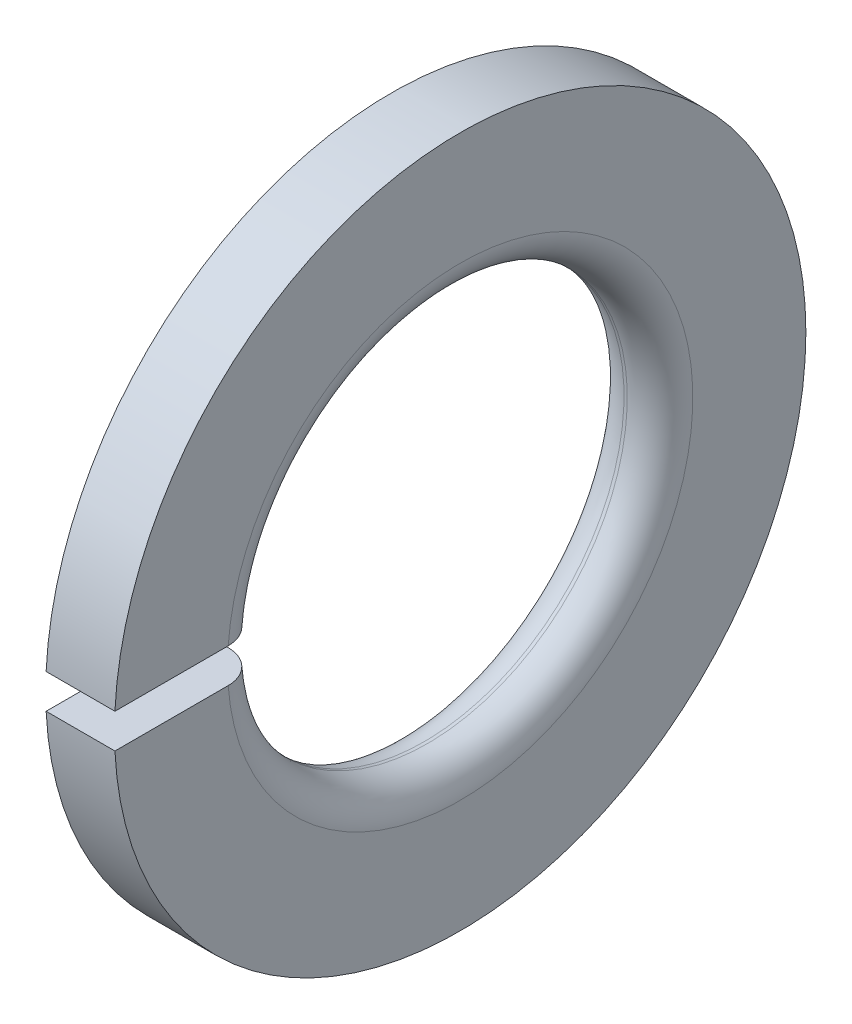
ISO-10303-21;
HEADER;
FILE_DESCRIPTION(('STEP AP214'),'2;1');
FILE_NAME('part.step','',(''),(''),'','','');
FILE_SCHEMA(('AUTOMOTIVE_DESIGN { 1 0 10303 214 1 1 1 1 }'));
ENDSEC;
DATA;
#1=APPLICATION_CONTEXT('core data for automotive mechanical design processes');
#2=APPLICATION_PROTOCOL_DEFINITION('international standard','automotive_design',2000,#1);
#3=PRODUCT_CONTEXT('',#1,'mechanical');
#4=PRODUCT('Part','Part','',(#3));
#5=PRODUCT_RELATED_PRODUCT_CATEGORY('part','',(#4));
#6=PRODUCT_DEFINITION_FORMATION('','',#4);
#7=PRODUCT_DEFINITION_CONTEXT('part definition',#1,'design');
#8=PRODUCT_DEFINITION('design','',#6,#7);
#9=PRODUCT_DEFINITION_SHAPE('','',#8);
#10=(LENGTH_UNIT() NAMED_UNIT(*) SI_UNIT(.MILLI.,.METRE.));
#11=(NAMED_UNIT(*) PLANE_ANGLE_UNIT() SI_UNIT($,.RADIAN.));
#12=(NAMED_UNIT(*) SI_UNIT($,.STERADIAN.) SOLID_ANGLE_UNIT());
#13=UNCERTAINTY_MEASURE_WITH_UNIT(LENGTH_MEASURE(1.E-05),#10,'distance_accuracy_value','');
#14=(GEOMETRIC_REPRESENTATION_CONTEXT(3) GLOBAL_UNCERTAINTY_ASSIGNED_CONTEXT((#13)) GLOBAL_UNIT_ASSIGNED_CONTEXT((#10,
#11,#12)) REPRESENTATION_CONTEXT('',''));
#15=CARTESIAN_POINT('',(0.,0.,0.));
#16=DIRECTION('',(0.,0.,1.));
#17=DIRECTION('',(1.,0.,0.));
#18=AXIS2_PLACEMENT_3D('',#15,#16,#17);
#19=CARTESIAN_POINT('',(-34.925,0.,0.));
#20=DIRECTION('',(-1.,0.,0.));
#21=DIRECTION('',(0.,0.,1.));
#22=AXIS2_PLACEMENT_3D('',#19,#20,#21);
#23=CYLINDRICAL_SURFACE('',#22,10.55);
#24=DIRECTION('',(-1.,0.,0.));
#25=VECTOR('',#24,1.);
#26=CARTESIAN_POINT('',(-34.925,0.525000000000032,10.536929106718));
#27=LINE('',#26,#25);
#28=CARTESIAN_POINT('',(0.,0.524999999999998,10.536929106718));
#29=VERTEX_POINT('',#28);
#30=CARTESIAN_POINT('',(-2.1,0.525000000000005,10.536929106718));
#31=VERTEX_POINT('',#30);
#32=EDGE_CURVE('E49',#29,#31,#27,.T.);
#33=ORIENTED_EDGE('',*,*,#32,.F.);
#34=CARTESIAN_POINT('',(0.,0.,0.));
#35=DIRECTION('',(-1.,0.,0.));
#36=DIRECTION('',(0.,0.,1.));
#37=AXIS2_PLACEMENT_3D('',#34,#35,#36);
#38=CIRCLE('',#37,10.55);
#39=CARTESIAN_POINT('',(0.,-0.524999999999998,10.5369291067179));
#40=VERTEX_POINT('',#39);
#41=EDGE_CURVE('E110',#29,#40,#38,.T.);
#42=ORIENTED_EDGE('',*,*,#41,.T.);
#43=DIRECTION('',(-1.,0.,0.));
#44=VECTOR('',#43,1.);
#45=CARTESIAN_POINT('',(-34.925,-0.52499999999997,10.536929106718));
#46=LINE('',#45,#44);
#47=CARTESIAN_POINT('',(-2.1,-0.524999999999998,10.5369291067179));
#48=VERTEX_POINT('',#47);
#49=EDGE_CURVE('E91',#48,#40,#46,.F.);
#50=ORIENTED_EDGE('',*,*,#49,.F.);
#51=CARTESIAN_POINT('',(-2.1,0.,0.));
#52=DIRECTION('',(-1.,0.,0.));
#53=DIRECTION('',(0.,0.,1.));
#54=AXIS2_PLACEMENT_3D('',#51,#52,#53);
#55=CIRCLE('',#54,10.55);
#56=EDGE_CURVE('E122',#31,#48,#55,.T.);
#57=ORIENTED_EDGE('',*,*,#56,.F.);
#58=EDGE_LOOP('',(#33,#42,#50,#57));
#59=FACE_BOUND('',#58,.T.);
#60=ADVANCED_FACE('F36',(#59),#23,.T.);
#61=CARTESIAN_POINT('',(0.,7.10000000000002,0.));
#62=DIRECTION('',(-1.,0.,0.));
#63=DIRECTION('',(0.,0.,1.));
#64=AXIS2_PLACEMENT_3D('',#61,#62,#63);
#65=PLANE('',#64);
#66=DIRECTION('',(0.,0.,-1.));
#67=VECTOR('',#66,1.);
#68=CARTESIAN_POINT('',(0.,0.524999999999998,10.761));
#69=LINE('',#68,#67);
#70=CARTESIAN_POINT('',(0.,0.524999999999998,7.08056318381525));
#71=VERTEX_POINT('',#70);
#72=EDGE_CURVE('E96',#29,#71,#69,.T.);
#73=ORIENTED_EDGE('',*,*,#72,.T.);
#74=CARTESIAN_POINT('',(0.,0.,0.));
#75=DIRECTION('',(-1.,0.,0.));
#76=DIRECTION('',(0.,0.,1.));
#77=AXIS2_PLACEMENT_3D('',#74,#75,#76);
#78=CIRCLE('',#77,7.1);
#79=CARTESIAN_POINT('',(0.,-0.524999999999998,7.08056318381525));
#80=VERTEX_POINT('',#79);
#81=EDGE_CURVE('E103',#71,#80,#78,.T.);
#82=ORIENTED_EDGE('',*,*,#81,.T.);
#83=DIRECTION('',(0.,0.,1.));
#84=VECTOR('',#83,1.);
#85=CARTESIAN_POINT('',(0.,-0.524999999999998,0.));
#86=LINE('',#85,#84);
#87=EDGE_CURVE('E85',#80,#40,#86,.T.);
#88=ORIENTED_EDGE('',*,*,#87,.T.);
#89=ORIENTED_EDGE('',*,*,#41,.F.);
#90=EDGE_LOOP('',(#73,#82,#88,#89));
#91=FACE_BOUND('',#90,.T.);
#92=ADVANCED_FACE('F109',(#91),#65,.F.);
#93=CARTESIAN_POINT('',(-1.,0.,0.));
#94=DIRECTION('',(-1.,0.,0.));
#95=DIRECTION('',(0.,0.,1.));
#96=AXIS2_PLACEMENT_3D('',#93,#94,#95);
#97=TOROIDAL_SURFACE('',#96,7.1,1.);
#98=ORIENTED_EDGE('',*,*,#81,.F.);
#99=CARTESIAN_POINT('',(-0.812651191733092,0.524999999999998,6.09513809676691));
#100=CARTESIAN_POINT('',(-0.867635601609136,0.524999999999998,6.08461486650465));
#101=CARTESIAN_POINT('',(-0.92354845188515,0.524999999999998,6.07872721250442));
#102=CARTESIAN_POINT('',(-1.03561462486792,0.524999999999998,6.07642288324873));
#103=CARTESIAN_POINT('',(-1.09176815419271,0.524999999999998,6.0800174545316));
#104=CARTESIAN_POINT('',(-1.20265038202385,0.524999999999998,6.09658440071776));
#105=CARTESIAN_POINT('',(-1.25737978521657,0.524999999999998,6.1095520425659));
#106=CARTESIAN_POINT('',(-1.3638725672551,0.524999999999998,6.1444807255819));
#107=CARTESIAN_POINT('',(-1.41563665183698,0.524999999999998,6.16643961664032));
#108=CARTESIAN_POINT('',(-1.51480465325,0.524999999999998,6.21874173811227));
#109=CARTESIAN_POINT('',(-1.56220424214721,0.524999999999998,6.24909317391404));
#110=CARTESIAN_POINT('',(-1.65125714513638,0.524999999999998,6.31730121336709));
#111=CARTESIAN_POINT('',(-1.69291015600293,0.524999999999998,6.35515821280218));
#112=CARTESIAN_POINT('',(-1.76942266073897,0.524999999999998,6.43742442778352));
#113=CARTESIAN_POINT('',(-1.80426101306002,0.524999999999998,6.48185330577894));
#114=CARTESIAN_POINT('',(-1.86601254338544,0.524999999999998,6.57591381055086));
#115=CARTESIAN_POINT('',(-1.89292559206825,0.524999999999998,6.62554552220695));
#116=CARTESIAN_POINT('',(-1.93814923335002,0.524999999999998,6.72877362821626));
#117=CARTESIAN_POINT('',(-1.9564321571561,0.524999999999998,6.78238214534372));
#118=CARTESIAN_POINT('',(-1.98375580773735,0.524999999999998,6.89190498853626));
#119=CARTESIAN_POINT('',(-1.99279644616772,0.524999999999998,6.94781933663691));
#120=CARTESIAN_POINT('',(-2.00138749269398,0.524999999999998,7.06046876730558));
#121=CARTESIAN_POINT('',(-2.00092170716771,0.524999999999998,7.11720508578784));
#122=CARTESIAN_POINT('',(-1.99046919624137,0.524999999999998,7.22979418626395));
#123=CARTESIAN_POINT('',(-1.98048245114082,0.524999999999998,7.28564696642937));
#124=CARTESIAN_POINT('',(-1.95126829991921,0.524999999999998,7.39486566816648));
#125=CARTESIAN_POINT('',(-1.93204335803051,0.524999999999998,7.44823224875489));
#126=CARTESIAN_POINT('',(-1.88489151384658,0.524999999999998,7.55097199946705));
#127=CARTESIAN_POINT('',(-1.85696468214514,0.524999999999998,7.60034520198285));
#128=CARTESIAN_POINT('',(-1.7932516504448,0.524999999999998,7.69360308767889));
#129=CARTESIAN_POINT('',(-1.75747923413963,0.524999999999998,7.73749718733122));
#130=CARTESIAN_POINT('',(-1.67905745237818,0.524999999999998,7.81863927947804));
#131=CARTESIAN_POINT('',(-1.63640816840443,0.524999999999998,7.8558873507089));
#132=CARTESIAN_POINT('',(-1.54554883853143,0.524999999999998,7.92258902486459));
#133=CARTESIAN_POINT('',(-1.49735183074451,0.524999999999998,7.95206038814106));
#134=CARTESIAN_POINT('',(-1.39668650789301,0.524999999999998,8.00247439358283));
#135=CARTESIAN_POINT('',(-1.34421824229176,0.524999999999998,8.02341713449703));
#136=CARTESIAN_POINT('',(-1.23661255133491,0.524999999999998,8.05613801790862));
#137=CARTESIAN_POINT('',(-1.18148066020401,0.524999999999998,8.06793436177104));
#138=CARTESIAN_POINT('',(-1.07001859143634,0.524999999999998,8.08209258223702));
#139=CARTESIAN_POINT('',(-1.01368842280445,0.524999999999998,8.08445452971336));
#140=CARTESIAN_POINT('',(-0.901493761658645,0.524999999999998,8.07967876415045));
#141=CARTESIAN_POINT('',(-0.845628830361044,0.524999999999998,8.07255135099469));
#142=CARTESIAN_POINT('',(-0.735888488372703,0.524999999999998,8.04901957603885));
#143=CARTESIAN_POINT('',(-0.682013074234789,0.524999999999998,8.03261523031342));
#144=CARTESIAN_POINT('',(-0.577772993933784,0.524999999999998,7.99099755957706));
#145=CARTESIAN_POINT('',(-0.527408710817197,0.524999999999998,7.96578327524504));
#146=CARTESIAN_POINT('',(-0.43162095205596,0.524999999999998,7.90726737931522));
#147=CARTESIAN_POINT('',(-0.386197502187292,0.524999999999998,7.87396572552912));
#148=CARTESIAN_POINT('',(-0.301516745674809,0.524999999999998,7.80017762775325));
#149=CARTESIAN_POINT('',(-0.262267364870932,0.524999999999998,7.75968208840675));
#150=CARTESIAN_POINT('',(-0.19110727232965,0.524999999999998,7.67268846366961));
#151=CARTESIAN_POINT('',(-0.159196627376645,0.524999999999998,7.62619032365976));
#152=CARTESIAN_POINT('',(-0.103547358484065,0.524999999999998,7.52840777006825));
#153=CARTESIAN_POINT('',(-0.0798260108357967,0.524999999999998,7.47711352456286));
#154=CARTESIAN_POINT('',(-0.0413094029115161,0.524999999999998,7.37127661987106));
#155=CARTESIAN_POINT('',(-0.02651427362221,0.524999999999998,7.31673391302841));
#156=CARTESIAN_POINT('',(-0.00623645854835806,0.524999999999998,7.20581585945528));
#157=CARTESIAN_POINT('',(-0.000774997327999499,0.524999999999998,7.14943663215111));
#158=CARTESIAN_POINT('',(0.000621201945926632,0.524999999999998,7.03656007759808));
#159=CARTESIAN_POINT('',(-0.00344418247725171,0.524999999999998,6.98006274884025));
#160=CARTESIAN_POINT('',(-0.0209988630405938,0.524999999999998,6.86845999383313));
#161=CARTESIAN_POINT('',(-0.0345029987104064,0.524999999999998,6.81335690113892));
#162=CARTESIAN_POINT('',(-0.0705702232944922,0.524999999999998,6.7062016776065));
#163=CARTESIAN_POINT('',(-0.0931329901304839,0.524999999999998,6.65414943837106));
#164=CARTESIAN_POINT('',(-0.14667933534619,0.524999999999998,6.55458295560761));
#165=CARTESIAN_POINT('',(-0.177661656097373,0.524999999999998,6.50706803577163));
#166=CARTESIAN_POINT('',(-0.247187964171999,0.524999999999998,6.41791501138345));
#167=CARTESIAN_POINT('',(-0.285733768337759,0.524999999999998,6.37627832299545));
#168=CARTESIAN_POINT('',(-0.369221248751562,0.524999999999998,6.30015644019462));
#169=CARTESIAN_POINT('',(-0.414152963572769,0.524999999999998,6.26566030926846));
#170=CARTESIAN_POINT('',(-0.509152346898679,0.524999999999998,6.20476708088215));
#171=CARTESIAN_POINT('',(-0.559213645064907,0.524999999999998,6.17836009650264));
#172=CARTESIAN_POINT('',(-0.643498874884662,0.524999999999998,6.14264746626716));
#173=CARTESIAN_POINT('',(-0.676607139318506,0.524999999999998,6.13064415460148));
#174=CARTESIAN_POINT('',(-0.743905094979395,0.524999999999998,6.11019627403516));
#175=CARTESIAN_POINT('',(-0.778094784426119,0.524999999999998,6.10175169927619));
#176=CARTESIAN_POINT('',(-0.812651191733092,0.524999999999998,6.09513809676691));
#177=B_SPLINE_CURVE_WITH_KNOTS('',3,(#99,#100,#101,#102,#103,#104,#105,#106,#107,#108,#109,#110,
#111,#112,#113,#114,#115,#116,#117,#118,#119,#120,#121,#122,#123,#124,#125,#126,#127,#128,#129,
#130,#131,#132,#133,#134,#135,#136,#137,#138,#139,#140,#141,#142,#143,#144,#145,#146,#147,#148,
#149,#150,#151,#152,#153,#154,#155,#156,#157,#158,#159,#160,#161,#162,#163,#164,#165,#166,#167,
#168,#169,#170,#171,#172,#173,#174,#175,#176),.UNSPECIFIED.,.T.,.F.,(4,2,2,2,2,2,2,2,2,2,2,2,2,
2,2,2,2,2,2,2,2,2,2,2,2,2,2,2,2,2,2,2,2,2,2,2,2,2,4),(0.,0.16781861044392,0.335836354186159,
0.503769314380745,0.671662139600457,0.83971969754576,1.00778611987008,1.17636595185943,
1.34494853450691,1.51406799423528,1.68318907052096,1.852598258409,2.02200779683398,
2.1913721713663,2.36073517197157,2.52980297346922,2.69886877186594,2.86754505098209,
3.03621937701959,3.2045571728161,3.37289370402848,3.54104766931508,3.70920134323298,
3.87737333324534,4.04554620055716,4.21393322500415,4.38232178175611,4.55106343388517,
4.71980756213288,4.88893490289837,5.05806441797011,5.22746043698935,5.39685043369166,
5.56621514250892,5.73562058474001,5.90476461293493,6.07370107312192,6.17917129305995,
6.28464133937424),.UNSPECIFIED.);
#178=CARTESIAN_POINT('',(-1.,0.524999999999998,6.07736579448695));
#179=VERTEX_POINT('',#178);
#180=EDGE_CURVE('E129',#71,#179,#177,.T.);
#181=ORIENTED_EDGE('',*,*,#180,.T.);
#182=CARTESIAN_POINT('',(-1.,0.,0.));
#183=DIRECTION('',(-1.,0.,0.));
#184=DIRECTION('',(0.,0.,1.));
#185=AXIS2_PLACEMENT_3D('',#182,#183,#184);
#186=CIRCLE('',#185,6.1);
#187=CARTESIAN_POINT('',(-1.,-0.524999999999998,6.07736579448695));
#188=VERTEX_POINT('',#187);
#189=EDGE_CURVE('E105',#179,#188,#186,.T.);
#190=ORIENTED_EDGE('',*,*,#189,.T.);
#191=CARTESIAN_POINT('',(-0.812651191733092,-0.524999999999998,6.09513809676691));
#192=CARTESIAN_POINT('',(-0.757551820377771,-0.524999999999998,6.1056884694128));
#193=CARTESIAN_POINT('',(-0.703304669040615,-0.524999999999998,6.12090939680118));
#194=CARTESIAN_POINT('',(-0.598094946051464,-0.524999999999998,6.16026480787611));
#195=CARTESIAN_POINT('',(-0.54713647672475,-0.524999999999998,6.18441018084276));
#196=CARTESIAN_POINT('',(-0.450021059862539,-0.524999999999998,6.2408970425833));
#197=CARTESIAN_POINT('',(-0.403861219137887,-0.524999999999998,6.27323355185951));
#198=CARTESIAN_POINT('',(-0.31762241527113,-0.524999999999998,6.34517125918678));
#199=CARTESIAN_POINT('',(-0.277541983733285,-0.524999999999998,6.3847706978582));
#200=CARTESIAN_POINT('',(-0.204475274845997,-0.524999999999998,6.47021702811072));
#201=CARTESIAN_POINT('',(-0.171506620941977,-0.524999999999998,6.51607899006993));
#202=CARTESIAN_POINT('',(-0.113707633488653,-0.524999999999998,6.6126750006121));
#203=CARTESIAN_POINT('',(-0.0888777550424566,-0.524999999999998,6.66340932144202));
#204=CARTESIAN_POINT('',(-0.047987396696231,-0.524999999999998,6.76847554061403));
#205=CARTESIAN_POINT('',(-0.0319538960509602,-0.524999999999998,6.82281794020464));
#206=CARTESIAN_POINT('',(-0.00922268898903943,-0.524999999999998,6.93342153693679));
#207=CARTESIAN_POINT('',(-0.00252506205877598,-0.524999999999998,6.98968275041109));
#208=CARTESIAN_POINT('',(0.00134687490663526,-0.524999999999998,7.102614877748));
#209=CARTESIAN_POINT('',(-0.00149276131528294,-0.524999999999998,7.15928627056479));
#210=CARTESIAN_POINT('',(-0.0166506062854997,-0.524999999999998,7.27134714691279));
#211=CARTESIAN_POINT('',(-0.0289687946216171,-0.524999999999998,7.32673663320434));
#212=CARTESIAN_POINT('',(-0.0627331921988976,-0.524999999999998,7.43463047400923));
#213=CARTESIAN_POINT('',(-0.0841749236050423,-0.524999999999998,7.48713622960314));
#214=CARTESIAN_POINT('',(-0.135585095866825,-0.524999999999998,7.5877931521059));
#215=CARTESIAN_POINT('',(-0.165553473435549,-0.524999999999998,7.63594435133185));
#216=CARTESIAN_POINT('',(-0.233108214576848,-0.524999999999998,7.72642784102522));
#217=CARTESIAN_POINT('',(-0.270680263456613,-0.524999999999998,7.76877081840132));
#218=CARTESIAN_POINT('',(-0.352414617320887,-0.524999999999998,7.84652983199311));
#219=CARTESIAN_POINT('',(-0.396576839430492,-0.524999999999998,7.88194595530469));
#220=CARTESIAN_POINT('',(-0.490128313916565,-0.524999999999998,7.94475961565249));
#221=CARTESIAN_POINT('',(-0.539505264712098,-0.524999999999998,7.97217547432638));
#222=CARTESIAN_POINT('',(-0.642167542773913,-0.524999999999998,8.01831006363213));
#223=CARTESIAN_POINT('',(-0.6954528267686,-0.524999999999998,8.03702889053743));
#224=CARTESIAN_POINT('',(-0.804309707920915,-0.524999999999998,8.06520338795658));
#225=CARTESIAN_POINT('',(-0.859876747627053,-0.524999999999998,8.0746766687945));
#226=CARTESIAN_POINT('',(-0.971812435768069,-0.524999999999998,8.08415006833351));
#227=CARTESIAN_POINT('',(-1.02818107863786,-0.524999999999998,8.08415025276898));
#228=CARTESIAN_POINT('',(-1.14006346169773,-0.524999999999998,8.07468209310413));
#229=CARTESIAN_POINT('',(-1.19557795969969,-0.524999999999998,8.06522270014708));
#230=CARTESIAN_POINT('',(-1.30423144094165,-0.524999999999998,8.03712034151211));
#231=CARTESIAN_POINT('',(-1.35737042597509,-0.524999999999998,8.01847738276766));
#232=CARTESIAN_POINT('',(-1.45978125760222,-0.524999999999998,7.97253595372865));
#233=CARTESIAN_POINT('',(-1.50905208951214,-0.524999999999998,7.9452352217515));
#234=CARTESIAN_POINT('',(-1.60231937757822,-0.524999999999998,7.88276033178289));
#235=CARTESIAN_POINT('',(-1.64631580508976,-0.524999999999998,7.8475861310346));
#236=CARTESIAN_POINT('',(-1.72785344320513,-0.524999999999998,7.77031242493912));
#237=CARTESIAN_POINT('',(-1.76538552963244,-0.524999999999998,7.72820329244293));
#238=CARTESIAN_POINT('',(-1.83286562277478,-0.524999999999998,7.63829324855709));
#239=CARTESIAN_POINT('',(-1.86281354537189,-0.524999999999998,7.59049227404641));
#240=CARTESIAN_POINT('',(-1.91434492958453,-0.524999999999998,7.4904454805055));
#241=CARTESIAN_POINT('',(-1.93591017809044,-0.524999999999998,7.43819028056313));
#242=CARTESIAN_POINT('',(-1.96998371435044,-0.524999999999998,7.33080620793395));
#243=CARTESIAN_POINT('',(-1.98249189521833,-0.524999999999998,7.27567730134156));
#244=CARTESIAN_POINT('',(-1.99812347198088,-0.524999999999998,7.16397881234495));
#245=CARTESIAN_POINT('',(-2.00122582734268,-0.524999999999998,7.10740628502484));
#246=CARTESIAN_POINT('',(-1.99790326108503,-0.524999999999998,6.99454140302497));
#247=CARTESIAN_POINT('',(-1.99147822288105,-0.524999999999998,6.93824905178212));
#248=CARTESIAN_POINT('',(-1.96926763971808,-0.524999999999998,6.82745983678813));
#249=CARTESIAN_POINT('',(-1.95346900171872,-0.524999999999998,6.77296559724565));
#250=CARTESIAN_POINT('',(-1.91294486876334,-0.524999999999998,6.66740346112664));
#251=CARTESIAN_POINT('',(-1.88821933805859,-0.524999999999998,6.6163355782723));
#252=CARTESIAN_POINT('',(-1.83054378340982,-0.524999999999998,6.51909489101566));
#253=CARTESIAN_POINT('',(-1.79759596405822,-0.524999999999998,6.47292077919656));
#254=CARTESIAN_POINT('',(-1.72440111454745,-0.524999999999998,6.38677676253839));
#255=CARTESIAN_POINT('',(-1.68415444353939,-0.524999999999998,6.34680655260639));
#256=CARTESIAN_POINT('',(-1.59760183615458,-0.524999999999998,6.274306679843));
#257=CARTESIAN_POINT('',(-1.55131036392622,-0.524999999999998,6.241759749429));
#258=CARTESIAN_POINT('',(-1.45389218246096,-0.524999999999998,6.18492227475377));
#259=CARTESIAN_POINT('',(-1.4027643594456,-0.524999999999998,6.16063363826697));
#260=CARTESIAN_POINT('',(-1.29730119774786,-0.524999999999998,6.12108940160189));
#261=CARTESIAN_POINT('',(-1.24297553119987,-0.524999999999998,6.10580796129274));
#262=CARTESIAN_POINT('',(-1.13257168095669,-0.524999999999998,6.0846310597706));
#263=CARTESIAN_POINT('',(-1.07649573567339,-0.524999999999998,6.07872407381752));
#264=CARTESIAN_POINT('',(-0.985554768608378,-0.524999999999998,6.07686069334113));
#265=CARTESIAN_POINT('',(-0.950724049159732,-0.524999999999998,6.07797678644269));
#266=CARTESIAN_POINT('',(-0.881369871431309,-0.524999999999998,6.08384165906486));
#267=CARTESIAN_POINT('',(-0.846846412428097,-0.524999999999998,6.08859043003013));
#268=CARTESIAN_POINT('',(-0.812651191733092,-0.524999999999998,6.09513809676691));
#269=B_SPLINE_CURVE_WITH_KNOTS('',3,(#191,#192,#193,#194,#195,#196,#197,#198,#199,#200,#201,
#202,#203,#204,#205,#206,#207,#208,#209,#210,#211,#212,#213,#214,#215,#216,#217,#218,#219,#220,
#221,#222,#223,#224,#225,#226,#227,#228,#229,#230,#231,#232,#233,#234,#235,#236,#237,#238,#239,
#240,#241,#242,#243,#244,#245,#246,#247,#248,#249,#250,#251,#252,#253,#254,#255,#256,#257,#258,
#259,#260,#261,#262,#263,#264,#265,#266,#267,#268),.UNSPECIFIED.,.T.,.F.,(4,2,2,2,2,2,2,2,2,2,2,
2,2,2,2,2,2,2,2,2,2,2,2,2,2,2,2,2,2,2,2,2,2,2,2,2,2,2,4),(0.,0.168173561321525,
0.336553002906052,0.504830329078217,0.673066945284253,0.841715791617975,1.01037406683033,
1.1795467802066,1.34872093392429,1.51814257717999,1.68756385558508,1.85690207776354,
2.02623904310391,2.19526013120715,2.36427909396017,2.53290788784446,2.70153481501588,
2.86983992189746,3.03814386089982,3.20628869252953,3.374433397212,3.54262206281087,
3.71081164177944,3.87923670251715,4.0476636312185,4.21645448401338,4.38524732874635,
4.55441748014898,4.72358970166495,4.89299878102249,5.06240853880469,5.23177292248634,
5.40112897459559,5.57008696917316,5.73908396879071,5.90759375449007,6.07589621718198,
6.1802666563824,6.28463684978024),.UNSPECIFIED.);
#270=EDGE_CURVE('E88',#188,#80,#269,.T.);
#271=ORIENTED_EDGE('',*,*,#270,.T.);
#272=EDGE_LOOP('',(#98,#181,#190,#271));
#273=FACE_BOUND('',#272,.T.);
#274=ADVANCED_FACE('F101',(#273),#97,.T.);
#275=CARTESIAN_POINT('',(-34.925,0.,0.));
#276=DIRECTION('',(-1.,0.,0.));
#277=DIRECTION('',(0.,0.,1.));
#278=AXIS2_PLACEMENT_3D('',#275,#276,#277);
#279=CYLINDRICAL_SURFACE('',#278,6.1);
#280=DIRECTION('',(-1.,0.,0.));
#281=VECTOR('',#280,1.);
#282=CARTESIAN_POINT('',(-34.925,0.525000000000032,6.07736579448695));
#283=LINE('',#282,#281);
#284=CARTESIAN_POINT('',(-1.1,0.524999999999998,6.07736579448695));
#285=VERTEX_POINT('',#284);
#286=EDGE_CURVE('E137',#285,#179,#283,.F.);
#287=ORIENTED_EDGE('',*,*,#286,.F.);
#288=CARTESIAN_POINT('',(-1.1,0.,0.));
#289=DIRECTION('',(-1.,0.,0.));
#290=DIRECTION('',(0.,0.,1.));
#291=AXIS2_PLACEMENT_3D('',#288,#289,#290);
#292=CIRCLE('',#291,6.1);
#293=CARTESIAN_POINT('',(-1.1,-0.524999999999998,6.07736579448695));
#294=VERTEX_POINT('',#293);
#295=EDGE_CURVE('E113',#285,#294,#292,.T.);
#296=ORIENTED_EDGE('',*,*,#295,.T.);
#297=DIRECTION('',(-1.,0.,0.));
#298=VECTOR('',#297,1.);
#299=CARTESIAN_POINT('',(-34.925,-0.52499999999997,6.07736579448695));
#300=LINE('',#299,#298);
#301=EDGE_CURVE('E106',#188,#294,#300,.T.);
#302=ORIENTED_EDGE('',*,*,#301,.F.);
#303=ORIENTED_EDGE('',*,*,#189,.F.);
#304=EDGE_LOOP('',(#287,#296,#302,#303));
#305=FACE_BOUND('',#304,.T.);
#306=ADVANCED_FACE('F136',(#305),#279,.F.);
#307=CARTESIAN_POINT('',(-1.1,0.,0.));
#308=DIRECTION('',(-1.,0.,0.));
#309=DIRECTION('',(0.,0.,1.));
#310=AXIS2_PLACEMENT_3D('',#307,#308,#309);
#311=TOROIDAL_SURFACE('',#310,7.1,1.);
#312=ORIENTED_EDGE('',*,*,#295,.F.);
#313=CARTESIAN_POINT('',(-1.45625333670171,0.524999999999998,6.14321813138294));
#314=CARTESIAN_POINT('',(-1.50873427205085,0.524999999999998,6.16330311942423));
#315=CARTESIAN_POINT('',(-1.55955360068141,0.524999999999998,6.18784634713152));
#316=CARTESIAN_POINT('',(-1.65638706058514,0.524999999999998,6.24514561447174));
#317=CARTESIAN_POINT('',(-1.7023951668367,0.524999999999998,6.27791178113825));
#318=CARTESIAN_POINT('',(-1.78823668340031,0.524999999999998,6.35068084397298));
#319=CARTESIAN_POINT('',(-1.82807391562946,0.524999999999998,6.39067922734173));
#320=CARTESIAN_POINT('',(-1.90047636318689,0.524999999999998,6.47677057698413));
#321=CARTESIAN_POINT('',(-1.93304336162146,0.524999999999998,6.52286204443546));
#322=CARTESIAN_POINT('',(-1.99008551463173,0.524999999999998,6.61996518269097));
#323=CARTESIAN_POINT('',(-2.01453981524313,0.524999999999998,6.67098910484014));
#324=CARTESIAN_POINT('',(-2.05455916522717,0.524999999999998,6.77641378610767));
#325=CARTESIAN_POINT('',(-2.07012373761965,0.524999999999998,6.83081472624703));
#326=CARTESIAN_POINT('',(-2.09195167112648,0.524999999999998,6.94158357277008));
#327=CARTESIAN_POINT('',(-2.09819333075749,0.524999999999998,6.99795575682199));
#328=CARTESIAN_POINT('',(-2.10112850415577,0.524999999999998,7.11094833049081));
#329=CARTESIAN_POINT('',(-2.09782198988537,0.524999999999998,7.16756872083608));
#330=CARTESIAN_POINT('',(-2.08174613004872,0.524999999999998,7.27947412466098));
#331=CARTESIAN_POINT('',(-2.06897288997063,0.524999999999998,7.33475857888225));
#332=CARTESIAN_POINT('',(-2.03431405467514,0.524999999999998,7.44239349287872));
#333=CARTESIAN_POINT('',(-2.01242852316393,0.524999999999998,7.49474397316312));
#334=CARTESIAN_POINT('',(-1.96019367603178,0.524999999999998,7.5949492048703));
#335=CARTESIAN_POINT('',(-1.92985555916538,0.524999999999998,7.64280979352126));
#336=CARTESIAN_POINT('',(-1.86155801604783,0.524999999999998,7.73274357904555));
#337=CARTESIAN_POINT('',(-1.82359866560491,0.524999999999998,7.77481683347832));
#338=CARTESIAN_POINT('',(-1.74122591675457,0.524999999999998,7.85188170461819));
#339=CARTESIAN_POINT('',(-1.69682700503942,0.524999999999998,7.88688880566625));
#340=CARTESIAN_POINT('',(-1.60277146554128,0.524999999999998,7.94893271941365));
#341=CARTESIAN_POINT('',(-1.55311490393917,0.524999999999998,7.97596963242186));
#342=CARTESIAN_POINT('',(-1.45007073728155,0.524999999999998,8.02124493385038));
#343=CARTESIAN_POINT('',(-1.39669153373566,0.524999999999998,8.03950244458679));
#344=CARTESIAN_POINT('',(-1.28762325470192,0.524999999999998,8.06678203143009));
#345=CARTESIAN_POINT('',(-1.23193420030199,0.524999999999998,8.07580419183236));
#346=CARTESIAN_POINT('',(-1.11991372636768,0.524999999999998,8.08434727168261));
#347=CARTESIAN_POINT('',(-1.06358335801182,0.524999999999998,8.08388198034008));
#348=CARTESIAN_POINT('',(-0.951801086675142,0.524999999999998,8.07349747290158));
#349=CARTESIAN_POINT('',(-0.89634918029667,0.524999999999998,8.06357829337993));
#350=CARTESIAN_POINT('',(-0.787915689078314,0.524999999999998,8.03457553709174));
#351=CARTESIAN_POINT('',(-0.734933312281229,0.524999999999998,8.01549492081466));
#352=CARTESIAN_POINT('',(-0.632919955383067,0.524999999999998,7.9687171434209));
#353=CARTESIAN_POINT('',(-0.5838889857235,0.524999999999998,7.94101995953607));
#354=CARTESIAN_POINT('',(-0.49112149506803,0.524999999999998,7.87777224721527));
#355=CARTESIAN_POINT('',(-0.447389707302113,0.524999999999998,7.84221477686123));
#356=CARTESIAN_POINT('',(-0.366502710282252,0.524999999999998,7.76427500720273));
#357=CARTESIAN_POINT('',(-0.329347556085086,0.524999999999998,7.7218926507689));
#358=CARTESIAN_POINT('',(-0.26259280955455,0.524999999999998,7.6314228972993));
#359=CARTESIAN_POINT('',(-0.233007444338887,0.524999999999998,7.58332500290415));
#360=CARTESIAN_POINT('',(-0.182310171566141,0.524999999999998,7.4828537284778));
#361=CARTESIAN_POINT('',(-0.161198371804034,0.524999999999998,7.43048029406627));
#362=CARTESIAN_POINT('',(-0.127996548585526,0.524999999999998,7.32281557968108));
#363=CARTESIAN_POINT('',(-0.115927418368472,0.524999999999998,7.26751785647978));
#364=CARTESIAN_POINT('',(-0.101224566142854,0.524999999999998,7.15568196132155));
#365=CARTESIAN_POINT('',(-0.0985909496019358,0.524999999999998,7.09914377550616));
#366=CARTESIAN_POINT('',(-0.102833030521147,0.524999999999998,6.98631637840221));
#367=CARTESIAN_POINT('',(-0.109726973277711,0.524999999999998,6.93002785247583));
#368=CARTESIAN_POINT('',(-0.13286080504338,0.524999999999998,6.81940480685292));
#369=CARTESIAN_POINT('',(-0.149100774478114,0.524999999999998,6.76507030397566));
#370=CARTESIAN_POINT('',(-0.19048284847603,0.524999999999998,6.65986600674406));
#371=CARTESIAN_POINT('',(-0.215630278453976,0.524999999999998,6.60899830679347));
#372=CARTESIAN_POINT('',(-0.274119058558699,0.524999999999998,6.5122139680643));
#373=CARTESIAN_POINT('',(-0.30746039121674,0.524999999999998,6.46629731873079));
#374=CARTESIAN_POINT('',(-0.381348592808719,0.524999999999998,6.38078854589324));
#375=CARTESIAN_POINT('',(-0.421885867538045,0.524999999999998,6.34118813292589));
#376=CARTESIAN_POINT('',(-0.509049460776127,0.524999999999998,6.26938140730713));
#377=CARTESIAN_POINT('',(-0.555675443467098,0.524999999999998,6.23717468713254));
#378=CARTESIAN_POINT('',(-0.653539286250299,0.524999999999998,6.18117605474247));
#379=CARTESIAN_POINT('',(-0.704762305731261,0.524999999999998,6.1573582057297));
#380=CARTESIAN_POINT('',(-0.810503174747228,0.524999999999998,6.11868667922326));
#381=CARTESIAN_POINT('',(-0.865021780165818,0.524999999999998,6.10383506689553));
#382=CARTESIAN_POINT('',(-0.975623812011181,0.524999999999998,6.08356616942027));
#383=CARTESIAN_POINT('',(-1.03170249521717,0.524999999999998,6.07812291348708));
#384=CARTESIAN_POINT('',(-1.14392866236902,0.524999999999998,6.07675769072237));
#385=CARTESIAN_POINT('',(-1.20007597810203,0.524999999999998,6.08082407867977));
#386=CARTESIAN_POINT('',(-1.2897339420396,0.524999999999998,6.09498038981748));
#387=CARTESIAN_POINT('',(-1.32372569210998,0.524999999999998,6.1021882062522));
#388=CARTESIAN_POINT('',(-1.39077413514759,0.524999999999998,6.12010286916448));
#389=CARTESIAN_POINT('',(-1.42383083011473,0.524999999999998,6.1308097081577));
#390=CARTESIAN_POINT('',(-1.45625333670171,0.524999999999998,6.14321813138294));
#391=B_SPLINE_CURVE_WITH_KNOTS('',3,(#313,#314,#315,#316,#317,#318,#319,#320,#321,#322,#323,
#324,#325,#326,#327,#328,#329,#330,#331,#332,#333,#334,#335,#336,#337,#338,#339,#340,#341,#342,
#343,#344,#345,#346,#347,#348,#349,#350,#351,#352,#353,#354,#355,#356,#357,#358,#359,#360,#361,
#362,#363,#364,#365,#366,#367,#368,#369,#370,#371,#372,#373,#374,#375,#376,#377,#378,#379,#380,
#381,#382,#383,#384,#385,#386,#387,#388,#389,#390),.UNSPECIFIED.,.T.,.F.,(4,2,2,2,2,2,2,2,2,2,2,
2,2,2,2,2,2,2,2,2,2,2,2,2,2,2,2,2,2,2,2,2,2,2,2,2,2,2,4),(0.,0.168451797914006,
0.337112081056443,0.50566748352852,0.674181500370177,0.843125391114075,1.01207834572552,
1.18142397231783,1.35077009618428,1.52018592597012,1.68960057134951,1.85879181949371,
2.02798138478004,2.19679607410601,2.36560863872245,2.53405183018113,2.70249348416577,
2.87069033991177,3.03888654495632,3.20702843446931,3.37517076827912,3.54346219678329,
3.71175503408504,3.8803618854065,4.04897088156243,4.21796826033242,4.38696752810397,
4.55629087866397,4.7256156863288,4.89504189787457,5.06446774822051,5.23366938029597,
5.40286168413004,5.57152618811328,5.74022952527109,5.90846642629471,6.07649741759268,
6.18056646997084,6.28463529974917),.UNSPECIFIED.);
#392=CARTESIAN_POINT('',(-2.1,0.524999999999998,7.08056318381525));
#393=VERTEX_POINT('',#392);
#394=EDGE_CURVE('E123',#285,#393,#391,.T.);
#395=ORIENTED_EDGE('',*,*,#394,.T.);
#396=CARTESIAN_POINT('',(-2.1,0.,0.));
#397=DIRECTION('',(-1.,0.,0.));
#398=DIRECTION('',(0.,0.,1.));
#399=AXIS2_PLACEMENT_3D('',#396,#397,#398);
#400=CIRCLE('',#399,7.1);
#401=CARTESIAN_POINT('',(-2.1,-0.524999999999998,7.08056318381525));
#402=VERTEX_POINT('',#401);
#403=EDGE_CURVE('E126',#393,#402,#400,.T.);
#404=ORIENTED_EDGE('',*,*,#403,.T.);
#405=CARTESIAN_POINT('',(-1.45625333670171,-0.524999999999998,6.14321813138294));
#406=CARTESIAN_POINT('',(-1.40396338684394,-0.524999999999998,6.12321160433755));
#407=CARTESIAN_POINT('',(-1.34994826560774,-0.524999999999998,6.1076015049569));
#408=CARTESIAN_POINT('',(-1.24001959369771,-0.524999999999998,6.08565972259131));
#409=CARTESIAN_POINT('',(-1.18410389171519,-0.524999999999998,6.0793389382106));
#410=CARTESIAN_POINT('',(-1.07202501841815,-0.524999999999998,6.07618335281238));
#411=CARTESIAN_POINT('',(-1.01586196757444,-0.524999999999998,6.07934435494251));
#412=CARTESIAN_POINT('',(-0.904879619281963,-0.524999999999998,6.09505236449142));
#413=CARTESIAN_POINT('',(-0.850060001464878,-0.524999999999998,6.1075971112269));
#414=CARTESIAN_POINT('',(-0.74330490222479,-0.524999999999998,6.14170361573484));
#415=CARTESIAN_POINT('',(-0.691369273753007,-0.524999999999998,6.16326491329254));
#416=CARTESIAN_POINT('',(-0.591841806795937,-0.524999999999998,6.21478272629006));
#417=CARTESIAN_POINT('',(-0.544250174174382,-0.524999999999998,6.24473963932797));
#418=CARTESIAN_POINT('',(-0.45464751365161,-0.524999999999998,6.31226435141227));
#419=CARTESIAN_POINT('',(-0.412649082872775,-0.524999999999998,6.34984886493712));
#420=CARTESIAN_POINT('',(-0.335531906951975,-0.524999999999998,6.43151400891372));
#421=CARTESIAN_POINT('',(-0.300413273544475,-0.524999999999998,6.47559474484994));
#422=CARTESIAN_POINT('',(-0.237927756240322,-0.524999999999998,6.56916098832081));
#423=CARTESIAN_POINT('',(-0.210587423019331,-0.524999999999998,6.61866422749906));
#424=CARTESIAN_POINT('',(-0.164580494346765,-0.524999999999998,6.72154928007484));
#425=CARTESIAN_POINT('',(-0.14591401967851,-0.524999999999998,6.77493114747024));
#426=CARTESIAN_POINT('',(-0.117739459465924,-0.524999999999998,6.88420884901742));
#427=CARTESIAN_POINT('',(-0.108255454090933,-0.524999999999998,6.94011089296054));
#428=CARTESIAN_POINT('',(-0.098799146217285,-0.524999999999998,7.05271407876029));
#429=CARTESIAN_POINT('',(-0.0988269157197297,-0.524999999999998,7.10941522666263));
#430=CARTESIAN_POINT('',(-0.108400925719395,-0.524999999999998,7.22205168076926));
#431=CARTESIAN_POINT('',(-0.117954332622019,-0.524999999999998,7.27798637823302));
#432=CARTESIAN_POINT('',(-0.146326251812081,-0.524999999999998,7.38745475627796));
#433=CARTESIAN_POINT('',(-0.165144727136632,-0.524999999999998,7.44098844643702));
#434=CARTESIAN_POINT('',(-0.211495246729914,-0.524999999999998,7.54407176996099));
#435=CARTESIAN_POINT('',(-0.23901792962229,-0.524999999999998,7.59362561218633));
#436=CARTESIAN_POINT('',(-0.302008953806543,-0.524999999999998,7.6873960646476));
#437=CARTESIAN_POINT('',(-0.337477213732032,-0.524999999999998,7.73161272953157));
#438=CARTESIAN_POINT('',(-0.415272448628566,-0.524999999999998,7.81335233335322));
#439=CARTESIAN_POINT('',(-0.457584652652758,-0.524999999999998,7.85088933021879));
#440=CARTESIAN_POINT('',(-0.547922604316171,-0.524999999999998,7.9183076103752));
#441=CARTESIAN_POINT('',(-0.595948281427542,-0.524999999999998,7.94818898815362));
#442=CARTESIAN_POINT('',(-0.69623339575709,-0.524999999999998,7.99937792217349));
#443=CARTESIAN_POINT('',(-0.748483058481806,-0.524999999999998,8.02070462848615));
#444=CARTESIAN_POINT('',(-0.855824785138394,-0.524999999999998,8.05426724831559));
#445=CARTESIAN_POINT('',(-0.910916820813996,-0.524999999999998,8.06650325218519));
#446=CARTESIAN_POINT('',(-1.02228383896306,-0.524999999999998,8.08152009814955));
#447=CARTESIAN_POINT('',(-1.07855676552888,-0.524999999999998,8.08431619056593));
#448=CARTESIAN_POINT('',(-1.19077247964337,-0.524999999999998,8.08041568885753));
#449=CARTESIAN_POINT('',(-1.24671526884065,-0.524999999999998,8.07371914217677));
#450=CARTESIAN_POINT('',(-1.3566520463781,-0.524999999999998,8.05103187615351));
#451=CARTESIAN_POINT('',(-1.41064705406612,-0.524999999999998,8.03504609542258));
#452=CARTESIAN_POINT('',(-1.51518957558512,-0.524999999999998,7.99424245930992));
#453=CARTESIAN_POINT('',(-1.56573708287748,-0.524999999999998,7.96942458717761));
#454=CARTESIAN_POINT('',(-1.66198907673035,-0.524999999999998,7.91164655738373));
#455=CARTESIAN_POINT('',(-1.70769021073888,-0.524999999999998,7.87868081514369));
#456=CARTESIAN_POINT('',(-1.79292126787159,-0.524999999999998,7.80555690771568));
#457=CARTESIAN_POINT('',(-1.83245115068211,-0.524999999999998,7.76539869554664));
#458=CARTESIAN_POINT('',(-1.90429251561452,-0.524999999999998,7.67895719044652));
#459=CARTESIAN_POINT('',(-1.93659140953184,-0.524999999999998,7.6326634359145));
#460=CARTESIAN_POINT('',(-1.99297934593807,-0.524999999999998,7.53532032930187));
#461=CARTESIAN_POINT('',(-2.01706827586282,-0.524999999999998,7.48427091203012));
#462=CARTESIAN_POINT('',(-2.05641064090645,-0.524999999999998,7.37874136434829));
#463=CARTESIAN_POINT('',(-2.07164382387788,-0.524999999999998,7.32425368372436));
#464=CARTESIAN_POINT('',(-2.09276708398684,-0.524999999999998,7.21349631851773));
#465=CARTESIAN_POINT('',(-2.09865702546543,-0.524999999999998,7.15722660807299));
#466=CARTESIAN_POINT('',(-2.10093554016092,-0.524999999999998,7.04437837570972));
#467=CARTESIAN_POINT('',(-2.09730442434329,-0.524999999999998,6.98779945569367));
#468=CARTESIAN_POINT('',(-2.08060414222631,-0.524999999999998,6.8760539922542));
#469=CARTESIAN_POINT('',(-2.06753526716063,-0.524999999999998,6.82088740530289));
#470=CARTESIAN_POINT('',(-2.03231416120701,-0.524999999999998,6.71348634844032));
#471=CARTESIAN_POINT('',(-2.01015483417326,-0.524999999999998,6.66125420549783));
#472=CARTESIAN_POINT('',(-1.95736643053349,-0.524999999999998,6.56124249509386));
#473=CARTESIAN_POINT('',(-1.92673526883799,-0.524999999999998,6.51346402764735));
#474=CARTESIAN_POINT('',(-1.85789211046835,-0.524999999999998,6.42376845863984));
#475=CARTESIAN_POINT('',(-1.81968404885727,-0.524999999999998,6.3818483337332));
#476=CARTESIAN_POINT('',(-1.736781486849,-0.524999999999998,6.30508131201253));
#477=CARTESIAN_POINT('',(-1.69209494964874,-0.524999999999998,6.27022585580535));
#478=CARTESIAN_POINT('',(-1.61520987064192,-0.524999999999998,6.220090086971));
#479=CARTESIAN_POINT('',(-1.584578907779,-0.524999999999998,6.20236024597543));
#480=CARTESIAN_POINT('',(-1.5216124373362,-0.524999999999998,6.17024180733261));
#481=CARTESIAN_POINT('',(-1.48927693141588,-0.524999999999998,6.15585320643239));
#482=CARTESIAN_POINT('',(-1.45625333670171,-0.524999999999998,6.14321813138294));
#483=B_SPLINE_CURVE_WITH_KNOTS('',3,(#405,#406,#407,#408,#409,#410,#411,#412,#413,#414,#415,
#416,#417,#418,#419,#420,#421,#422,#423,#424,#425,#426,#427,#428,#429,#430,#431,#432,#433,#434,
#435,#436,#437,#438,#439,#440,#441,#442,#443,#444,#445,#446,#447,#448,#449,#450,#451,#452,#453,
#454,#455,#456,#457,#458,#459,#460,#461,#462,#463,#464,#465,#466,#467,#468,#469,#470,#471,#472,
#473,#474,#475,#476,#477,#478,#479,#480,#481,#482),.UNSPECIFIED.,.T.,.F.,(4,2,2,2,2,2,2,2,2,2,2,
2,2,2,2,2,2,2,2,2,2,2,2,2,2,2,2,2,2,2,2,2,2,2,2,2,2,2,4),(0.,0.167830972660985,
0.335858694722918,0.503812054904611,0.67172496565613,0.839629306992056,1.00754160125636,
1.17582589627702,1.34411292416843,1.51296767848103,1.68182478402252,1.85112351175759,
2.02042352103005,2.18985099564511,2.35927779433662,2.52852299063704,2.69776645386751,
2.86664940515355,3.03553027194287,3.20403095172223,3.37252995674476,3.54075661844882,
3.70898243936267,3.87711890491571,4.04525568935114,4.21350803646146,4.38176148263276,
4.55030559692807,4.71885202198417,4.88778239364826,5.05671521806986,5.22599766186974,
5.39527488211627,5.56468449495818,5.73413584008523,5.9034994100508,6.07265653992158,
6.17864989873587,6.28464315435606),.UNSPECIFIED.);
#484=EDGE_CURVE('E57',#402,#294,#483,.T.);
#485=ORIENTED_EDGE('',*,*,#484,.T.);
#486=EDGE_LOOP('',(#312,#395,#404,#485));
#487=FACE_BOUND('',#486,.T.);
#488=ADVANCED_FACE('F140',(#487),#311,.T.);
#489=CARTESIAN_POINT('',(-2.1,10.55,0.));
#490=DIRECTION('',(1.,0.,0.));
#491=DIRECTION('',(0.,0.,-1.));
#492=AXIS2_PLACEMENT_3D('',#489,#490,#491);
#493=PLANE('',#492);
#494=DIRECTION('',(0.,0.,-1.));
#495=VECTOR('',#494,1.);
#496=CARTESIAN_POINT('',(-2.1,0.525000000000005,0.));
#497=LINE('',#496,#495);
#498=EDGE_CURVE('E11',#31,#393,#497,.T.);
#499=ORIENTED_EDGE('',*,*,#498,.F.);
#500=ORIENTED_EDGE('',*,*,#56,.T.);
#501=DIRECTION('',(0.,0.,1.));
#502=VECTOR('',#501,1.);
#503=CARTESIAN_POINT('',(-2.1,-0.524999999999998,0.));
#504=LINE('',#503,#502);
#505=EDGE_CURVE('E43',#402,#48,#504,.T.);
#506=ORIENTED_EDGE('',*,*,#505,.F.);
#507=ORIENTED_EDGE('',*,*,#403,.F.);
#508=EDGE_LOOP('',(#499,#500,#506,#507));
#509=FACE_BOUND('',#508,.T.);
#510=ADVANCED_FACE('F125',(#509),#493,.F.);
#511=CARTESIAN_POINT('',(-2.1,-0.524999999999998,0.));
#512=DIRECTION('',(0.,1.,0.));
#513=DIRECTION('',(0.,0.,1.));
#514=AXIS2_PLACEMENT_3D('',#511,#512,#513);
#515=PLANE('',#514);
#516=ORIENTED_EDGE('',*,*,#49,.T.);
#517=ORIENTED_EDGE('',*,*,#87,.F.);
#518=ORIENTED_EDGE('',*,*,#270,.F.);
#519=ORIENTED_EDGE('',*,*,#301,.T.);
#520=ORIENTED_EDGE('',*,*,#484,.F.);
#521=ORIENTED_EDGE('',*,*,#505,.T.);
#522=EDGE_LOOP('',(#516,#517,#518,#519,#520,#521));
#523=FACE_BOUND('',#522,.T.);
#524=ADVANCED_FACE('F87',(#523),#515,.T.);
#525=CARTESIAN_POINT('',(-2.1,0.524999999999998,10.761));
#526=DIRECTION('',(0.,-1.,0.));
#527=DIRECTION('',(0.,0.,-1.));
#528=AXIS2_PLACEMENT_3D('',#525,#526,#527);
#529=PLANE('',#528);
#530=ORIENTED_EDGE('',*,*,#32,.T.);
#531=ORIENTED_EDGE('',*,*,#498,.T.);
#532=ORIENTED_EDGE('',*,*,#394,.F.);
#533=ORIENTED_EDGE('',*,*,#286,.T.);
#534=ORIENTED_EDGE('',*,*,#180,.F.);
#535=ORIENTED_EDGE('',*,*,#72,.F.);
#536=EDGE_LOOP('',(#530,#531,#532,#533,#534,#535));
#537=FACE_BOUND('',#536,.T.);
#538=ADVANCED_FACE('F155',(#537),#529,.T.);
#539=CLOSED_SHELL('',(#60,#92,#274,#306,#488,#510,#524,#538));
#540=MANIFOLD_SOLID_BREP('B2',#539);
#541=ADVANCED_BREP_SHAPE_REPRESENTATION('',(#18,#540),#14);
#542=SHAPE_DEFINITION_REPRESENTATION(#9,#541);
ENDSEC;
END-ISO-10303-21;
